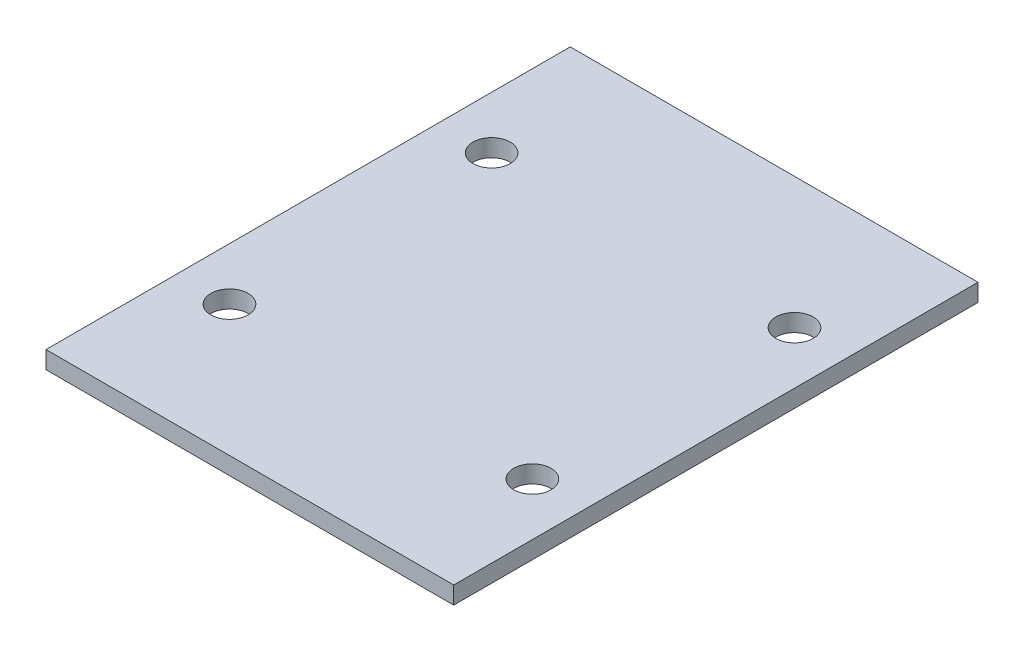
ISO-10303-21;
HEADER;
FILE_DESCRIPTION(('STEP AP214'),'2;1');
FILE_NAME('part.step','',(''),(''),'','','');
FILE_SCHEMA(('AUTOMOTIVE_DESIGN { 1 0 10303 214 1 1 1 1 }'));
ENDSEC;
DATA;
#1=APPLICATION_CONTEXT('core data for automotive mechanical design processes');
#2=APPLICATION_PROTOCOL_DEFINITION('international standard','automotive_design',2000,#1);
#3=PRODUCT_CONTEXT('',#1,'mechanical');
#4=PRODUCT('Part','Part','',(#3));
#5=PRODUCT_RELATED_PRODUCT_CATEGORY('part','',(#4));
#6=PRODUCT_DEFINITION_FORMATION('','',#4);
#7=PRODUCT_DEFINITION_CONTEXT('part definition',#1,'design');
#8=PRODUCT_DEFINITION('design','',#6,#7);
#9=PRODUCT_DEFINITION_SHAPE('','',#8);
#10=(LENGTH_UNIT() NAMED_UNIT(*) SI_UNIT(.MILLI.,.METRE.));
#11=(NAMED_UNIT(*) PLANE_ANGLE_UNIT() SI_UNIT($,.RADIAN.));
#12=(NAMED_UNIT(*) SI_UNIT($,.STERADIAN.) SOLID_ANGLE_UNIT());
#13=UNCERTAINTY_MEASURE_WITH_UNIT(LENGTH_MEASURE(1.E-05),#10,'distance_accuracy_value','');
#14=(GEOMETRIC_REPRESENTATION_CONTEXT(3) GLOBAL_UNCERTAINTY_ASSIGNED_CONTEXT((#13)) GLOBAL_UNIT_ASSIGNED_CONTEXT((#10,
#11,#12)) REPRESENTATION_CONTEXT('',''));
#15=CARTESIAN_POINT('',(0.,0.,0.));
#16=DIRECTION('',(0.,0.,1.));
#17=DIRECTION('',(1.,0.,0.));
#18=AXIS2_PLACEMENT_3D('',#15,#16,#17);
#19=CARTESIAN_POINT('',(35.,3.,45.));
#20=DIRECTION('',(-1.,0.,0.));
#21=DIRECTION('',(0.,0.,1.));
#22=AXIS2_PLACEMENT_3D('',#19,#20,#21);
#23=PLANE('',#22);
#24=DIRECTION('',(0.,0.,-1.));
#25=VECTOR('',#24,1.);
#26=CARTESIAN_POINT('',(35.,0.,45.));
#27=LINE('',#26,#25);
#28=CARTESIAN_POINT('',(35.,0.,45.));
#29=VERTEX_POINT('',#28);
#30=CARTESIAN_POINT('',(35.,0.,-45.));
#31=VERTEX_POINT('',#30);
#32=EDGE_CURVE('E95',#29,#31,#27,.T.);
#33=ORIENTED_EDGE('',*,*,#32,.T.);
#34=DIRECTION('',(0.,-1.,0.));
#35=VECTOR('',#34,1.);
#36=CARTESIAN_POINT('',(35.,3.,-45.));
#37=LINE('',#36,#35);
#38=CARTESIAN_POINT('',(35.,3.,-45.));
#39=VERTEX_POINT('',#38);
#40=EDGE_CURVE('E11',#39,#31,#37,.T.);
#41=ORIENTED_EDGE('',*,*,#40,.F.);
#42=DIRECTION('',(0.,0.,-1.));
#43=VECTOR('',#42,1.);
#44=CARTESIAN_POINT('',(35.,3.,45.));
#45=LINE('',#44,#43);
#46=CARTESIAN_POINT('',(35.,3.,45.));
#47=VERTEX_POINT('',#46);
#48=EDGE_CURVE('E83',#47,#39,#45,.T.);
#49=ORIENTED_EDGE('',*,*,#48,.F.);
#50=DIRECTION('',(0.,-1.,0.));
#51=VECTOR('',#50,1.);
#52=CARTESIAN_POINT('',(35.,3.,45.));
#53=LINE('',#52,#51);
#54=EDGE_CURVE('E91',#47,#29,#53,.T.);
#55=ORIENTED_EDGE('',*,*,#54,.T.);
#56=EDGE_LOOP('',(#33,#41,#49,#55));
#57=FACE_BOUND('',#56,.T.);
#58=ADVANCED_FACE('F32',(#57),#23,.F.);
#59=CARTESIAN_POINT('',(-35.,3.,-45.));
#60=DIRECTION('',(0.,0.,1.));
#61=DIRECTION('',(1.,0.,0.));
#62=AXIS2_PLACEMENT_3D('',#59,#60,#61);
#63=PLANE('',#62);
#64=DIRECTION('',(-1.,0.,0.));
#65=VECTOR('',#64,1.);
#66=CARTESIAN_POINT('',(-35.,0.,-45.));
#67=LINE('',#66,#65);
#68=CARTESIAN_POINT('',(-35.,0.,-45.));
#69=VERTEX_POINT('',#68);
#70=EDGE_CURVE('E87',#31,#69,#67,.T.);
#71=ORIENTED_EDGE('',*,*,#70,.T.);
#72=DIRECTION('',(0.,-1.,0.));
#73=VECTOR('',#72,1.);
#74=CARTESIAN_POINT('',(-35.,3.,-45.));
#75=LINE('',#74,#73);
#76=CARTESIAN_POINT('',(-35.,3.,-45.));
#77=VERTEX_POINT('',#76);
#78=EDGE_CURVE('E40',#77,#69,#75,.T.);
#79=ORIENTED_EDGE('',*,*,#78,.F.);
#80=DIRECTION('',(-1.,0.,0.));
#81=VECTOR('',#80,1.);
#82=CARTESIAN_POINT('',(-35.,3.,-45.));
#83=LINE('',#82,#81);
#84=EDGE_CURVE('E78',#39,#77,#83,.T.);
#85=ORIENTED_EDGE('',*,*,#84,.F.);
#86=ORIENTED_EDGE('',*,*,#40,.T.);
#87=EDGE_LOOP('',(#71,#79,#85,#86));
#88=FACE_BOUND('',#87,.T.);
#89=ADVANCED_FACE('F86',(#88),#63,.F.);
#90=CARTESIAN_POINT('',(-35.,3.,45.));
#91=DIRECTION('',(1.,0.,0.));
#92=DIRECTION('',(0.,0.,-1.));
#93=AXIS2_PLACEMENT_3D('',#90,#91,#92);
#94=PLANE('',#93);
#95=DIRECTION('',(0.,0.,1.));
#96=VECTOR('',#95,1.);
#97=CARTESIAN_POINT('',(-35.,0.,45.));
#98=LINE('',#97,#96);
#99=CARTESIAN_POINT('',(-35.,0.,45.));
#100=VERTEX_POINT('',#99);
#101=EDGE_CURVE('E65',#69,#100,#98,.T.);
#102=ORIENTED_EDGE('',*,*,#101,.T.);
#103=DIRECTION('',(0.,-1.,0.));
#104=VECTOR('',#103,1.);
#105=CARTESIAN_POINT('',(-35.,3.,45.));
#106=LINE('',#105,#104);
#107=CARTESIAN_POINT('',(-35.,3.,45.));
#108=VERTEX_POINT('',#107);
#109=EDGE_CURVE('E88',#108,#100,#106,.T.);
#110=ORIENTED_EDGE('',*,*,#109,.F.);
#111=DIRECTION('',(0.,0.,1.));
#112=VECTOR('',#111,1.);
#113=CARTESIAN_POINT('',(-35.,3.,45.));
#114=LINE('',#113,#112);
#115=EDGE_CURVE('E81',#77,#108,#114,.T.);
#116=ORIENTED_EDGE('',*,*,#115,.F.);
#117=ORIENTED_EDGE('',*,*,#78,.T.);
#118=EDGE_LOOP('',(#102,#110,#116,#117));
#119=FACE_BOUND('',#118,.T.);
#120=ADVANCED_FACE('F89',(#119),#94,.F.);
#121=CARTESIAN_POINT('',(-35.,3.,45.));
#122=DIRECTION('',(0.,0.,-1.));
#123=DIRECTION('',(-1.,0.,0.));
#124=AXIS2_PLACEMENT_3D('',#121,#122,#123);
#125=PLANE('',#124);
#126=DIRECTION('',(1.,0.,0.));
#127=VECTOR('',#126,1.);
#128=CARTESIAN_POINT('',(-35.,0.,45.));
#129=LINE('',#128,#127);
#130=EDGE_CURVE('E71',#100,#29,#129,.T.);
#131=ORIENTED_EDGE('',*,*,#130,.T.);
#132=ORIENTED_EDGE('',*,*,#54,.F.);
#133=DIRECTION('',(1.,0.,0.));
#134=VECTOR('',#133,1.);
#135=CARTESIAN_POINT('',(-35.,3.,45.));
#136=LINE('',#135,#134);
#137=EDGE_CURVE('E48',#108,#47,#136,.T.);
#138=ORIENTED_EDGE('',*,*,#137,.F.);
#139=ORIENTED_EDGE('',*,*,#109,.T.);
#140=EDGE_LOOP('',(#131,#132,#138,#139));
#141=FACE_BOUND('',#140,.T.);
#142=ADVANCED_FACE('F103',(#141),#125,.F.);
#143=CARTESIAN_POINT('',(0.,3.,0.));
#144=DIRECTION('',(0.,-1.,0.));
#145=DIRECTION('',(0.,0.,-1.));
#146=AXIS2_PLACEMENT_3D('',#143,#144,#145);
#147=PLANE('',#146);
#148=CARTESIAN_POINT('',(-26.,3.,-22.5000000000001));
#149=DIRECTION('',(0.,1.,0.));
#150=DIRECTION('',(0.,0.,1.));
#151=AXIS2_PLACEMENT_3D('',#148,#149,#150);
#152=CIRCLE('',#151,3.19999999999999);
#153=CARTESIAN_POINT('',(-26.,3.,-19.3000000000001));
#154=VERTEX_POINT('',#153);
#155=EDGE_CURVE('E129',#154,#154,#152,.T.);
#156=ORIENTED_EDGE('',*,*,#155,.F.);
#157=EDGE_LOOP('',(#156));
#158=FACE_BOUND('',#157,.T.);
#159=CARTESIAN_POINT('',(26.,3.,-22.5000000000001));
#160=DIRECTION('',(0.,1.,0.));
#161=DIRECTION('',(0.,0.,1.));
#162=AXIS2_PLACEMENT_3D('',#159,#160,#161);
#163=CIRCLE('',#162,3.19999999999999);
#164=CARTESIAN_POINT('',(26.,3.,-19.3000000000001));
#165=VERTEX_POINT('',#164);
#166=EDGE_CURVE('E123',#165,#165,#163,.T.);
#167=ORIENTED_EDGE('',*,*,#166,.F.);
#168=EDGE_LOOP('',(#167));
#169=FACE_BOUND('',#168,.T.);
#170=CARTESIAN_POINT('',(26.,3.,22.4999999999999));
#171=DIRECTION('',(0.,1.,0.));
#172=DIRECTION('',(0.,0.,1.));
#173=AXIS2_PLACEMENT_3D('',#170,#171,#172);
#174=CIRCLE('',#173,3.19999999999999);
#175=CARTESIAN_POINT('',(26.,3.,25.6999999999999));
#176=VERTEX_POINT('',#175);
#177=EDGE_CURVE('E117',#176,#176,#174,.T.);
#178=ORIENTED_EDGE('',*,*,#177,.F.);
#179=EDGE_LOOP('',(#178));
#180=FACE_BOUND('',#179,.T.);
#181=CARTESIAN_POINT('',(-26.,3.,22.5000000000001));
#182=DIRECTION('',(0.,1.,0.));
#183=DIRECTION('',(0.,0.,1.));
#184=AXIS2_PLACEMENT_3D('',#181,#182,#183);
#185=CIRCLE('',#184,3.19999999999999);
#186=CARTESIAN_POINT('',(-26.,3.,25.7));
#187=VERTEX_POINT('',#186);
#188=EDGE_CURVE('E111',#187,#187,#185,.T.);
#189=ORIENTED_EDGE('',*,*,#188,.F.);
#190=EDGE_LOOP('',(#189));
#191=FACE_BOUND('',#190,.T.);
#192=ORIENTED_EDGE('',*,*,#48,.T.);
#193=ORIENTED_EDGE('',*,*,#84,.T.);
#194=ORIENTED_EDGE('',*,*,#115,.T.);
#195=ORIENTED_EDGE('',*,*,#137,.T.);
#196=EDGE_LOOP('',(#192,#193,#194,#195));
#197=FACE_BOUND('',#196,.T.);
#198=ADVANCED_FACE('F79',(#158,#169,#180,#191,#197),#147,.F.);
#199=CARTESIAN_POINT('',(0.,0.,0.));
#200=DIRECTION('',(0.,-1.,0.));
#201=DIRECTION('',(0.,0.,-1.));
#202=AXIS2_PLACEMENT_3D('',#199,#200,#201);
#203=PLANE('',#202);
#204=CARTESIAN_POINT('',(-26.,0.,-22.5000000000001));
#205=DIRECTION('',(0.,1.,0.));
#206=DIRECTION('',(0.,0.,1.));
#207=AXIS2_PLACEMENT_3D('',#204,#205,#206);
#208=CIRCLE('',#207,3.2);
#209=CARTESIAN_POINT('',(-26.,0.,-19.3000000000001));
#210=VERTEX_POINT('',#209);
#211=EDGE_CURVE('E126',#210,#210,#208,.T.);
#212=ORIENTED_EDGE('',*,*,#211,.T.);
#213=EDGE_LOOP('',(#212));
#214=FACE_BOUND('',#213,.T.);
#215=CARTESIAN_POINT('',(26.,0.,-22.5000000000001));
#216=DIRECTION('',(0.,1.,0.));
#217=DIRECTION('',(0.,0.,1.));
#218=AXIS2_PLACEMENT_3D('',#215,#216,#217);
#219=CIRCLE('',#218,3.2);
#220=CARTESIAN_POINT('',(26.,0.,-19.3000000000001));
#221=VERTEX_POINT('',#220);
#222=EDGE_CURVE('E120',#221,#221,#219,.T.);
#223=ORIENTED_EDGE('',*,*,#222,.T.);
#224=EDGE_LOOP('',(#223));
#225=FACE_BOUND('',#224,.T.);
#226=CARTESIAN_POINT('',(26.,0.,22.4999999999999));
#227=DIRECTION('',(0.,1.,0.));
#228=DIRECTION('',(0.,0.,1.));
#229=AXIS2_PLACEMENT_3D('',#226,#227,#228);
#230=CIRCLE('',#229,3.2);
#231=CARTESIAN_POINT('',(26.,0.,25.6999999999999));
#232=VERTEX_POINT('',#231);
#233=EDGE_CURVE('E114',#232,#232,#230,.T.);
#234=ORIENTED_EDGE('',*,*,#233,.T.);
#235=EDGE_LOOP('',(#234));
#236=FACE_BOUND('',#235,.T.);
#237=CARTESIAN_POINT('',(-26.,0.,22.5000000000001));
#238=DIRECTION('',(0.,1.,0.));
#239=DIRECTION('',(0.,0.,1.));
#240=AXIS2_PLACEMENT_3D('',#237,#238,#239);
#241=CIRCLE('',#240,3.2);
#242=CARTESIAN_POINT('',(-26.,0.,25.7000000000001));
#243=VERTEX_POINT('',#242);
#244=EDGE_CURVE('E98',#243,#243,#241,.T.);
#245=ORIENTED_EDGE('',*,*,#244,.T.);
#246=EDGE_LOOP('',(#245));
#247=FACE_BOUND('',#246,.T.);
#248=ORIENTED_EDGE('',*,*,#32,.F.);
#249=ORIENTED_EDGE('',*,*,#130,.F.);
#250=ORIENTED_EDGE('',*,*,#101,.F.);
#251=ORIENTED_EDGE('',*,*,#70,.F.);
#252=EDGE_LOOP('',(#248,#249,#250,#251));
#253=FACE_BOUND('',#252,.T.);
#254=ADVANCED_FACE('F106',(#214,#225,#236,#247,#253),#203,.T.);
#255=CARTESIAN_POINT('',(-26.,3.,22.5000000000001));
#256=DIRECTION('',(0.,1.,0.));
#257=DIRECTION('',(0.,0.,1.));
#258=AXIS2_PLACEMENT_3D('',#255,#256,#257);
#259=CYLINDRICAL_SURFACE('',#258,3.19999999999999);
#260=ORIENTED_EDGE('',*,*,#244,.F.);
#261=EDGE_LOOP('',(#260));
#262=FACE_BOUND('',#261,.T.);
#263=ORIENTED_EDGE('',*,*,#188,.T.);
#264=EDGE_LOOP('',(#263));
#265=FACE_BOUND('',#264,.T.);
#266=ADVANCED_FACE('F144',(#262,#265),#259,.F.);
#267=CARTESIAN_POINT('',(26.,3.,22.4999999999999));
#268=DIRECTION('',(0.,1.,0.));
#269=DIRECTION('',(0.,0.,1.));
#270=AXIS2_PLACEMENT_3D('',#267,#268,#269);
#271=CYLINDRICAL_SURFACE('',#270,3.19999999999999);
#272=ORIENTED_EDGE('',*,*,#233,.F.);
#273=EDGE_LOOP('',(#272));
#274=FACE_BOUND('',#273,.T.);
#275=ORIENTED_EDGE('',*,*,#177,.T.);
#276=EDGE_LOOP('',(#275));
#277=FACE_BOUND('',#276,.T.);
#278=ADVANCED_FACE('F146',(#274,#277),#271,.F.);
#279=CARTESIAN_POINT('',(26.,3.,-22.5000000000001));
#280=DIRECTION('',(0.,1.,0.));
#281=DIRECTION('',(0.,0.,1.));
#282=AXIS2_PLACEMENT_3D('',#279,#280,#281);
#283=CYLINDRICAL_SURFACE('',#282,3.19999999999999);
#284=ORIENTED_EDGE('',*,*,#222,.F.);
#285=EDGE_LOOP('',(#284));
#286=FACE_BOUND('',#285,.T.);
#287=ORIENTED_EDGE('',*,*,#166,.T.);
#288=EDGE_LOOP('',(#287));
#289=FACE_BOUND('',#288,.T.);
#290=ADVANCED_FACE('F153',(#286,#289),#283,.F.);
#291=CARTESIAN_POINT('',(-26.,3.,-22.5000000000001));
#292=DIRECTION('',(0.,1.,0.));
#293=DIRECTION('',(0.,0.,1.));
#294=AXIS2_PLACEMENT_3D('',#291,#292,#293);
#295=CYLINDRICAL_SURFACE('',#294,3.19999999999999);
#296=ORIENTED_EDGE('',*,*,#211,.F.);
#297=EDGE_LOOP('',(#296));
#298=FACE_BOUND('',#297,.T.);
#299=ORIENTED_EDGE('',*,*,#155,.T.);
#300=EDGE_LOOP('',(#299));
#301=FACE_BOUND('',#300,.T.);
#302=ADVANCED_FACE('F133',(#298,#301),#295,.F.);
#303=CLOSED_SHELL('',(#58,#89,#120,#142,#198,#254,#266,#278,#290,#302));
#304=MANIFOLD_SOLID_BREP('B2',#303);
#305=ADVANCED_BREP_SHAPE_REPRESENTATION('',(#18,#304),#14);
#306=SHAPE_DEFINITION_REPRESENTATION(#9,#305);
ENDSEC;
END-ISO-10303-21;
